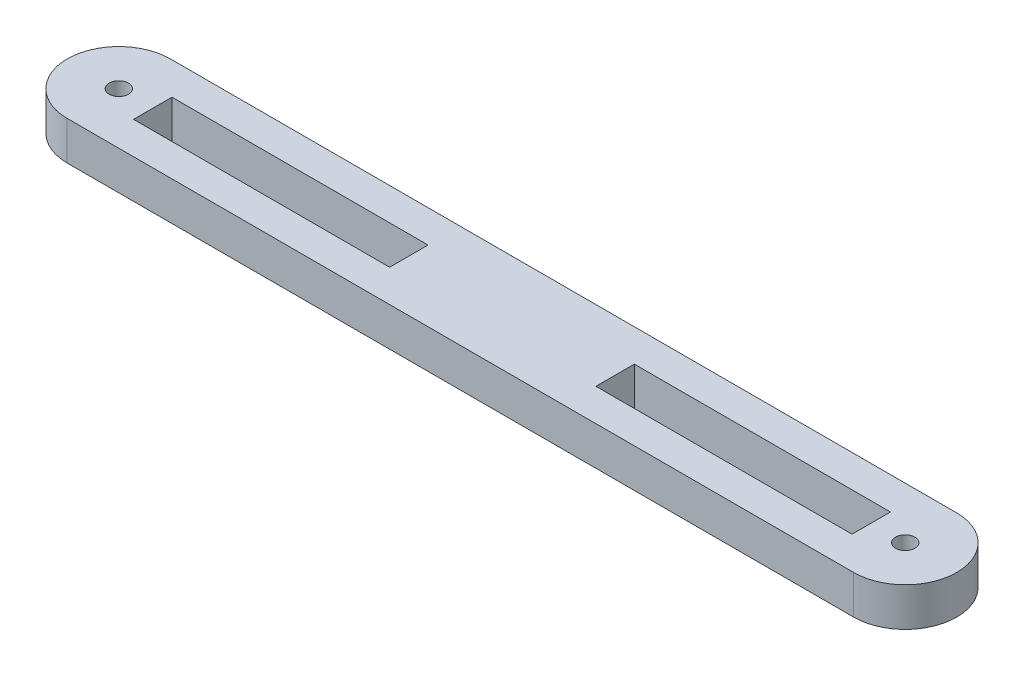
ISO-10303-21;
HEADER;
FILE_DESCRIPTION(('STEP AP214'),'2;1');
FILE_NAME('part.step','',(''),(''),'','','');
FILE_SCHEMA(('AUTOMOTIVE_DESIGN { 1 0 10303 214 1 1 1 1 }'));
ENDSEC;
DATA;
#1=APPLICATION_CONTEXT('core data for automotive mechanical design processes');
#2=APPLICATION_PROTOCOL_DEFINITION('international standard','automotive_design',2000,#1);
#3=PRODUCT_CONTEXT('',#1,'mechanical');
#4=PRODUCT('Part','Part','',(#3));
#5=PRODUCT_RELATED_PRODUCT_CATEGORY('part','',(#4));
#6=PRODUCT_DEFINITION_FORMATION('','',#4);
#7=PRODUCT_DEFINITION_CONTEXT('part definition',#1,'design');
#8=PRODUCT_DEFINITION('design','',#6,#7);
#9=PRODUCT_DEFINITION_SHAPE('','',#8);
#10=(LENGTH_UNIT() NAMED_UNIT(*) SI_UNIT(.MILLI.,.METRE.));
#11=(NAMED_UNIT(*) PLANE_ANGLE_UNIT() SI_UNIT($,.RADIAN.));
#12=(NAMED_UNIT(*) SI_UNIT($,.STERADIAN.) SOLID_ANGLE_UNIT());
#13=UNCERTAINTY_MEASURE_WITH_UNIT(LENGTH_MEASURE(1.E-05),#10,'distance_accuracy_value','');
#14=(GEOMETRIC_REPRESENTATION_CONTEXT(3) GLOBAL_UNCERTAINTY_ASSIGNED_CONTEXT((#13)) GLOBAL_UNIT_ASSIGNED_CONTEXT((#10,
#11,#12)) REPRESENTATION_CONTEXT('',''));
#15=CARTESIAN_POINT('',(0.,0.,0.));
#16=DIRECTION('',(0.,0.,1.));
#17=DIRECTION('',(1.,0.,0.));
#18=AXIS2_PLACEMENT_3D('',#15,#16,#17);
#19=CARTESIAN_POINT('',(0.,6.,0.));
#20=DIRECTION('',(0.,1.,0.));
#21=DIRECTION('',(0.,0.,1.));
#22=AXIS2_PLACEMENT_3D('',#19,#20,#21);
#23=PLANE('',#22);
#24=DIRECTION('',(1.,0.,0.));
#25=VECTOR('',#24,1.);
#26=CARTESIAN_POINT('',(0.,6.,2.98042204926586));
#27=LINE('',#26,#25);
#28=CARTESIAN_POINT('',(5.26854851105268,6.,2.98042204926586));
#29=VERTEX_POINT('',#28);
#30=CARTESIAN_POINT('',(44.999839524994,6.,2.98042204926586));
#31=VERTEX_POINT('',#30);
#32=EDGE_CURVE('E88',#29,#31,#27,.T.);
#33=ORIENTED_EDGE('',*,*,#32,.F.);
#34=DIRECTION('',(0.,0.,1.));
#35=VECTOR('',#34,1.);
#36=CARTESIAN_POINT('',(5.26854851105268,6.,0.));
#37=LINE('',#36,#35);
#38=CARTESIAN_POINT('',(5.26854851105268,6.,-2.98042204926586));
#39=VERTEX_POINT('',#38);
#40=EDGE_CURVE('E187',#39,#29,#37,.T.);
#41=ORIENTED_EDGE('',*,*,#40,.F.);
#42=DIRECTION('',(1.,0.,0.));
#43=VECTOR('',#42,1.);
#44=CARTESIAN_POINT('',(0.,6.,-2.98042204926586));
#45=LINE('',#44,#43);
#46=CARTESIAN_POINT('',(44.999839524994,6.,-2.98042204926586));
#47=VERTEX_POINT('',#46);
#48=EDGE_CURVE('E169',#39,#47,#45,.T.);
#49=ORIENTED_EDGE('',*,*,#48,.T.);
#50=DIRECTION('',(0.,0.,-1.));
#51=VECTOR('',#50,1.);
#52=CARTESIAN_POINT('',(44.999839524994,6.,0.));
#53=LINE('',#52,#51);
#54=EDGE_CURVE('E180',#31,#47,#53,.T.);
#55=ORIENTED_EDGE('',*,*,#54,.F.);
#56=EDGE_LOOP('',(#33,#41,#49,#55));
#57=FACE_BOUND('',#56,.T.);
#58=CARTESIAN_POINT('',(122.,6.,0.));
#59=DIRECTION('',(0.,1.,0.));
#60=DIRECTION('',(0.,0.,1.));
#61=AXIS2_PLACEMENT_3D('',#58,#59,#60);
#62=CIRCLE('',#61,1.5);
#63=CARTESIAN_POINT('',(122.,6.,1.5));
#64=VERTEX_POINT('',#63);
#65=EDGE_CURVE('E236',#64,#64,#62,.T.);
#66=ORIENTED_EDGE('',*,*,#65,.F.);
#67=EDGE_LOOP('',(#66));
#68=FACE_BOUND('',#67,.T.);
#69=CARTESIAN_POINT('',(0.,6.,0.));
#70=DIRECTION('',(0.,1.,0.));
#71=DIRECTION('',(0.,0.,1.));
#72=AXIS2_PLACEMENT_3D('',#69,#70,#71);
#73=CIRCLE('',#72,8.);
#74=CARTESIAN_POINT('',(0.,6.,-8.));
#75=VERTEX_POINT('',#74);
#76=CARTESIAN_POINT('',(0.,6.,8.));
#77=VERTEX_POINT('',#76);
#78=EDGE_CURVE('E244',#75,#77,#73,.T.);
#79=ORIENTED_EDGE('',*,*,#78,.T.);
#80=DIRECTION('',(1.,0.,0.));
#81=VECTOR('',#80,1.);
#82=CARTESIAN_POINT('',(0.,6.,8.));
#83=LINE('',#82,#81);
#84=CARTESIAN_POINT('',(122.,6.,8.));
#85=VERTEX_POINT('',#84);
#86=EDGE_CURVE('E248',#77,#85,#83,.T.);
#87=ORIENTED_EDGE('',*,*,#86,.T.);
#88=CARTESIAN_POINT('',(122.,6.,0.));
#89=DIRECTION('',(0.,1.,0.));
#90=DIRECTION('',(0.,0.,1.));
#91=AXIS2_PLACEMENT_3D('',#88,#89,#90);
#92=CIRCLE('',#91,8.);
#93=CARTESIAN_POINT('',(122.,6.,-8.));
#94=VERTEX_POINT('',#93);
#95=EDGE_CURVE('E252',#85,#94,#92,.T.);
#96=ORIENTED_EDGE('',*,*,#95,.T.);
#97=DIRECTION('',(1.,0.,0.));
#98=VECTOR('',#97,1.);
#99=CARTESIAN_POINT('',(0.,6.,-8.));
#100=LINE('',#99,#98);
#101=EDGE_CURVE('E255',#75,#94,#100,.T.);
#102=ORIENTED_EDGE('',*,*,#101,.F.);
#103=EDGE_LOOP('',(#79,#87,#96,#102));
#104=FACE_BOUND('',#103,.T.);
#105=CARTESIAN_POINT('',(0.,6.,0.));
#106=DIRECTION('',(0.,1.,0.));
#107=DIRECTION('',(0.,0.,1.));
#108=AXIS2_PLACEMENT_3D('',#105,#106,#107);
#109=CIRCLE('',#108,1.5);
#110=CARTESIAN_POINT('',(0.,6.,1.5));
#111=VERTEX_POINT('',#110);
#112=EDGE_CURVE('E228',#111,#111,#109,.T.);
#113=ORIENTED_EDGE('',*,*,#112,.F.);
#114=EDGE_LOOP('',(#113));
#115=FACE_BOUND('',#114,.T.);
#116=DIRECTION('',(-1.,0.,0.));
#117=VECTOR('',#116,1.);
#118=CARTESIAN_POINT('',(105.999839524994,6.,-2.98042204926586));
#119=LINE('',#118,#117);
#120=CARTESIAN_POINT('',(116.731451488947,6.,-2.98042204926586));
#121=VERTEX_POINT('',#120);
#122=CARTESIAN_POINT('',(77.000160475006,6.,-2.98042204926586));
#123=VERTEX_POINT('',#122);
#124=EDGE_CURVE('E214',#121,#123,#119,.T.);
#125=ORIENTED_EDGE('',*,*,#124,.F.);
#126=DIRECTION('',(0.,0.,1.));
#127=VECTOR('',#126,1.);
#128=CARTESIAN_POINT('',(116.731451488947,6.,-2.98042204926586));
#129=LINE('',#128,#127);
#130=CARTESIAN_POINT('',(116.731451488947,6.,2.98042204926586));
#131=VERTEX_POINT('',#130);
#132=EDGE_CURVE('E96',#121,#131,#129,.T.);
#133=ORIENTED_EDGE('',*,*,#132,.T.);
#134=DIRECTION('',(-1.,0.,0.));
#135=VECTOR('',#134,1.);
#136=CARTESIAN_POINT('',(105.999839524994,6.,2.98042204926586));
#137=LINE('',#136,#135);
#138=CARTESIAN_POINT('',(77.000160475006,6.,2.98042204926586));
#139=VERTEX_POINT('',#138);
#140=EDGE_CURVE('E222',#131,#139,#137,.T.);
#141=ORIENTED_EDGE('',*,*,#140,.T.);
#142=DIRECTION('',(0.,0.,-1.));
#143=VECTOR('',#142,1.);
#144=CARTESIAN_POINT('',(77.000160475006,6.,2.98042204926586));
#145=LINE('',#144,#143);
#146=EDGE_CURVE('E218',#139,#123,#145,.T.);
#147=ORIENTED_EDGE('',*,*,#146,.T.);
#148=EDGE_LOOP('',(#125,#133,#141,#147));
#149=FACE_BOUND('',#148,.T.);
#150=ADVANCED_FACE('F72',(#57,#68,#104,#115,#149),#23,.T.);
#151=CARTESIAN_POINT('',(0.,0.,0.));
#152=DIRECTION('',(0.,1.,0.));
#153=DIRECTION('',(0.,0.,1.));
#154=AXIS2_PLACEMENT_3D('',#151,#152,#153);
#155=PLANE('',#154);
#156=DIRECTION('',(0.,0.,1.));
#157=VECTOR('',#156,1.);
#158=CARTESIAN_POINT('',(5.26854851105268,0.,0.));
#159=LINE('',#158,#157);
#160=CARTESIAN_POINT('',(5.26854851105268,0.,-2.98042204926586));
#161=VERTEX_POINT('',#160);
#162=CARTESIAN_POINT('',(5.26854851105268,0.,2.98042204926586));
#163=VERTEX_POINT('',#162);
#164=EDGE_CURVE('E81',#161,#163,#159,.T.);
#165=ORIENTED_EDGE('',*,*,#164,.T.);
#166=DIRECTION('',(1.,0.,0.));
#167=VECTOR('',#166,1.);
#168=CARTESIAN_POINT('',(0.,0.,2.98042204926586));
#169=LINE('',#168,#167);
#170=CARTESIAN_POINT('',(44.999839524994,0.,2.98042204926586));
#171=VERTEX_POINT('',#170);
#172=EDGE_CURVE('E12',#163,#171,#169,.T.);
#173=ORIENTED_EDGE('',*,*,#172,.T.);
#174=DIRECTION('',(0.,0.,-1.));
#175=VECTOR('',#174,1.);
#176=CARTESIAN_POINT('',(44.999839524994,0.,0.));
#177=LINE('',#176,#175);
#178=CARTESIAN_POINT('',(44.999839524994,0.,-2.98042204926586));
#179=VERTEX_POINT('',#178);
#180=EDGE_CURVE('E300',#171,#179,#177,.T.);
#181=ORIENTED_EDGE('',*,*,#180,.T.);
#182=DIRECTION('',(1.,0.,0.));
#183=VECTOR('',#182,1.);
#184=CARTESIAN_POINT('',(0.,0.,-2.98042204926586));
#185=LINE('',#184,#183);
#186=EDGE_CURVE('E172',#161,#179,#185,.T.);
#187=ORIENTED_EDGE('',*,*,#186,.F.);
#188=EDGE_LOOP('',(#165,#173,#181,#187));
#189=FACE_BOUND('',#188,.T.);
#190=CARTESIAN_POINT('',(0.,0.,0.));
#191=DIRECTION('',(0.,1.,0.));
#192=DIRECTION('',(0.,0.,1.));
#193=AXIS2_PLACEMENT_3D('',#190,#191,#192);
#194=CIRCLE('',#193,1.5);
#195=CARTESIAN_POINT('',(0.,0.,1.5));
#196=VERTEX_POINT('',#195);
#197=EDGE_CURVE('E197',#196,#196,#194,.T.);
#198=ORIENTED_EDGE('',*,*,#197,.T.);
#199=EDGE_LOOP('',(#198));
#200=FACE_BOUND('',#199,.T.);
#201=CARTESIAN_POINT('',(122.,0.,0.));
#202=DIRECTION('',(0.,1.,0.));
#203=DIRECTION('',(0.,0.,1.));
#204=AXIS2_PLACEMENT_3D('',#201,#202,#203);
#205=CIRCLE('',#204,1.5);
#206=CARTESIAN_POINT('',(122.,0.,1.5));
#207=VERTEX_POINT('',#206);
#208=EDGE_CURVE('E232',#207,#207,#205,.T.);
#209=ORIENTED_EDGE('',*,*,#208,.T.);
#210=EDGE_LOOP('',(#209));
#211=FACE_BOUND('',#210,.T.);
#212=CARTESIAN_POINT('',(0.,0.,0.));
#213=DIRECTION('',(0.,1.,0.));
#214=DIRECTION('',(0.,0.,1.));
#215=AXIS2_PLACEMENT_3D('',#212,#213,#214);
#216=CIRCLE('',#215,8.);
#217=CARTESIAN_POINT('',(0.,0.,-8.));
#218=VERTEX_POINT('',#217);
#219=CARTESIAN_POINT('',(0.,0.,8.));
#220=VERTEX_POINT('',#219);
#221=EDGE_CURVE('E240',#218,#220,#216,.T.);
#222=ORIENTED_EDGE('',*,*,#221,.F.);
#223=DIRECTION('',(1.,0.,0.));
#224=VECTOR('',#223,1.);
#225=CARTESIAN_POINT('',(0.,0.,-8.));
#226=LINE('',#225,#224);
#227=CARTESIAN_POINT('',(122.,0.,-8.));
#228=VERTEX_POINT('',#227);
#229=EDGE_CURVE('E249',#218,#228,#226,.T.);
#230=ORIENTED_EDGE('',*,*,#229,.T.);
#231=CARTESIAN_POINT('',(122.,0.,0.));
#232=DIRECTION('',(0.,1.,0.));
#233=DIRECTION('',(0.,0.,1.));
#234=AXIS2_PLACEMENT_3D('',#231,#232,#233);
#235=CIRCLE('',#234,8.);
#236=CARTESIAN_POINT('',(122.,0.,8.));
#237=VERTEX_POINT('',#236);
#238=EDGE_CURVE('E266',#237,#228,#235,.T.);
#239=ORIENTED_EDGE('',*,*,#238,.F.);
#240=DIRECTION('',(1.,0.,0.));
#241=VECTOR('',#240,1.);
#242=CARTESIAN_POINT('',(0.,0.,8.));
#243=LINE('',#242,#241);
#244=EDGE_CURVE('E263',#220,#237,#243,.T.);
#245=ORIENTED_EDGE('',*,*,#244,.F.);
#246=EDGE_LOOP('',(#222,#230,#239,#245));
#247=FACE_BOUND('',#246,.T.);
#248=DIRECTION('',(0.,0.,1.));
#249=VECTOR('',#248,1.);
#250=CARTESIAN_POINT('',(116.731451488947,0.,0.));
#251=LINE('',#250,#249);
#252=CARTESIAN_POINT('',(116.731451488947,0.,-2.98042204926586));
#253=VERTEX_POINT('',#252);
#254=CARTESIAN_POINT('',(116.731451488947,0.,2.98042204926586));
#255=VERTEX_POINT('',#254);
#256=EDGE_CURVE('E297',#253,#255,#251,.T.);
#257=ORIENTED_EDGE('',*,*,#256,.F.);
#258=DIRECTION('',(-1.,0.,0.));
#259=VECTOR('',#258,1.);
#260=CARTESIAN_POINT('',(0.,0.,-2.98042204926586));
#261=LINE('',#260,#259);
#262=CARTESIAN_POINT('',(77.000160475006,0.,-2.98042204926586));
#263=VERTEX_POINT('',#262);
#264=EDGE_CURVE('E286',#253,#263,#261,.T.);
#265=ORIENTED_EDGE('',*,*,#264,.T.);
#266=DIRECTION('',(0.,0.,-1.));
#267=VECTOR('',#266,1.);
#268=CARTESIAN_POINT('',(77.000160475006,0.,0.));
#269=LINE('',#268,#267);
#270=CARTESIAN_POINT('',(77.000160475006,0.,2.98042204926586));
#271=VERTEX_POINT('',#270);
#272=EDGE_CURVE('E290',#271,#263,#269,.T.);
#273=ORIENTED_EDGE('',*,*,#272,.F.);
#274=DIRECTION('',(-1.,0.,0.));
#275=VECTOR('',#274,1.);
#276=CARTESIAN_POINT('',(0.,0.,2.98042204926586));
#277=LINE('',#276,#275);
#278=EDGE_CURVE('E294',#255,#271,#277,.T.);
#279=ORIENTED_EDGE('',*,*,#278,.F.);
#280=EDGE_LOOP('',(#257,#265,#273,#279));
#281=FACE_BOUND('',#280,.T.);
#282=ADVANCED_FACE('F307',(#189,#200,#211,#247,#281),#155,.F.);
#283=CARTESIAN_POINT('',(0.,6.,0.));
#284=DIRECTION('',(0.,-1.,0.));
#285=DIRECTION('',(0.,0.,-1.));
#286=AXIS2_PLACEMENT_3D('',#283,#284,#285);
#287=CYLINDRICAL_SURFACE('',#286,8.);
#288=ORIENTED_EDGE('',*,*,#221,.T.);
#289=DIRECTION('',(0.,-1.,0.));
#290=VECTOR('',#289,1.);
#291=CARTESIAN_POINT('',(0.,6.,8.));
#292=LINE('',#291,#290);
#293=EDGE_CURVE('E282',#77,#220,#292,.T.);
#294=ORIENTED_EDGE('',*,*,#293,.F.);
#295=ORIENTED_EDGE('',*,*,#78,.F.);
#296=DIRECTION('',(0.,-1.,0.));
#297=VECTOR('',#296,1.);
#298=CARTESIAN_POINT('',(0.,6.,-8.));
#299=LINE('',#298,#297);
#300=EDGE_CURVE('E259',#75,#218,#299,.T.);
#301=ORIENTED_EDGE('',*,*,#300,.T.);
#302=EDGE_LOOP('',(#288,#294,#295,#301));
#303=FACE_BOUND('',#302,.T.);
#304=ADVANCED_FACE('F74',(#303),#287,.T.);
#305=CARTESIAN_POINT('',(0.,6.,8.));
#306=DIRECTION('',(0.,0.,-1.));
#307=DIRECTION('',(-1.,0.,0.));
#308=AXIS2_PLACEMENT_3D('',#305,#306,#307);
#309=PLANE('',#308);
#310=ORIENTED_EDGE('',*,*,#244,.T.);
#311=DIRECTION('',(0.,-1.,0.));
#312=VECTOR('',#311,1.);
#313=CARTESIAN_POINT('',(122.,6.,8.));
#314=LINE('',#313,#312);
#315=EDGE_CURVE('E278',#85,#237,#314,.T.);
#316=ORIENTED_EDGE('',*,*,#315,.F.);
#317=ORIENTED_EDGE('',*,*,#86,.F.);
#318=ORIENTED_EDGE('',*,*,#293,.T.);
#319=EDGE_LOOP('',(#310,#316,#317,#318));
#320=FACE_BOUND('',#319,.T.);
#321=ADVANCED_FACE('F343',(#320),#309,.F.);
#322=CARTESIAN_POINT('',(122.,6.,0.));
#323=DIRECTION('',(0.,-1.,0.));
#324=DIRECTION('',(0.,0.,-1.));
#325=AXIS2_PLACEMENT_3D('',#322,#323,#324);
#326=CYLINDRICAL_SURFACE('',#325,8.);
#327=ORIENTED_EDGE('',*,*,#238,.T.);
#328=DIRECTION('',(0.,-1.,0.));
#329=VECTOR('',#328,1.);
#330=CARTESIAN_POINT('',(122.,6.,-8.));
#331=LINE('',#330,#329);
#332=EDGE_CURVE('E275',#94,#228,#331,.T.);
#333=ORIENTED_EDGE('',*,*,#332,.F.);
#334=ORIENTED_EDGE('',*,*,#95,.F.);
#335=ORIENTED_EDGE('',*,*,#315,.T.);
#336=EDGE_LOOP('',(#327,#333,#334,#335));
#337=FACE_BOUND('',#336,.T.);
#338=ADVANCED_FACE('F340',(#337),#326,.T.);
#339=CARTESIAN_POINT('',(0.,6.,-8.));
#340=DIRECTION('',(0.,0.,-1.));
#341=DIRECTION('',(-1.,0.,0.));
#342=AXIS2_PLACEMENT_3D('',#339,#340,#341);
#343=PLANE('',#342);
#344=ORIENTED_EDGE('',*,*,#229,.F.);
#345=ORIENTED_EDGE('',*,*,#300,.F.);
#346=ORIENTED_EDGE('',*,*,#101,.T.);
#347=ORIENTED_EDGE('',*,*,#332,.T.);
#348=EDGE_LOOP('',(#344,#345,#346,#347));
#349=FACE_BOUND('',#348,.T.);
#350=ADVANCED_FACE('F337',(#349),#343,.T.);
#351=CARTESIAN_POINT('',(122.,6.,0.));
#352=DIRECTION('',(0.,-1.,0.));
#353=DIRECTION('',(0.,0.,-1.));
#354=AXIS2_PLACEMENT_3D('',#351,#352,#353);
#355=CYLINDRICAL_SURFACE('',#354,1.5);
#356=ORIENTED_EDGE('',*,*,#65,.T.);
#357=EDGE_LOOP('',(#356));
#358=FACE_BOUND('',#357,.T.);
#359=ORIENTED_EDGE('',*,*,#208,.F.);
#360=EDGE_LOOP('',(#359));
#361=FACE_BOUND('',#360,.T.);
#362=ADVANCED_FACE('F334',(#358,#361),#355,.F.);
#363=CARTESIAN_POINT('',(0.,6.,0.));
#364=DIRECTION('',(0.,-1.,0.));
#365=DIRECTION('',(0.,0.,-1.));
#366=AXIS2_PLACEMENT_3D('',#363,#364,#365);
#367=CYLINDRICAL_SURFACE('',#366,1.5);
#368=ORIENTED_EDGE('',*,*,#112,.T.);
#369=EDGE_LOOP('',(#368));
#370=FACE_BOUND('',#369,.T.);
#371=ORIENTED_EDGE('',*,*,#197,.F.);
#372=EDGE_LOOP('',(#371));
#373=FACE_BOUND('',#372,.T.);
#374=ADVANCED_FACE('F384',(#370,#373),#367,.F.);
#375=CARTESIAN_POINT('',(116.731451488947,-8.,-2.98042204926586));
#376=DIRECTION('',(-1.,0.,0.));
#377=DIRECTION('',(0.,0.,1.));
#378=AXIS2_PLACEMENT_3D('',#375,#376,#377);
#379=PLANE('',#378);
#380=ORIENTED_EDGE('',*,*,#256,.T.);
#381=DIRECTION('',(0.,1.,0.));
#382=VECTOR('',#381,1.);
#383=CARTESIAN_POINT('',(116.731451488947,-8.,2.98042204926586));
#384=LINE('',#383,#382);
#385=EDGE_CURVE('E205',#255,#131,#384,.T.);
#386=ORIENTED_EDGE('',*,*,#385,.T.);
#387=ORIENTED_EDGE('',*,*,#132,.F.);
#388=DIRECTION('',(0.,1.,0.));
#389=VECTOR('',#388,1.);
#390=CARTESIAN_POINT('',(116.731451488947,-8.,-2.98042204926586));
#391=LINE('',#390,#389);
#392=EDGE_CURVE('E202',#253,#121,#391,.T.);
#393=ORIENTED_EDGE('',*,*,#392,.F.);
#394=EDGE_LOOP('',(#380,#386,#387,#393));
#395=FACE_BOUND('',#394,.T.);
#396=ADVANCED_FACE('F369',(#395),#379,.T.);
#397=CARTESIAN_POINT('',(105.999839524994,-8.,2.98042204926586));
#398=DIRECTION('',(0.,0.,-1.));
#399=DIRECTION('',(-1.,0.,0.));
#400=AXIS2_PLACEMENT_3D('',#397,#398,#399);
#401=PLANE('',#400);
#402=ORIENTED_EDGE('',*,*,#278,.T.);
#403=DIRECTION('',(0.,1.,0.));
#404=VECTOR('',#403,1.);
#405=CARTESIAN_POINT('',(77.000160475006,-8.,2.98042204926586));
#406=LINE('',#405,#404);
#407=EDGE_CURVE('E208',#271,#139,#406,.T.);
#408=ORIENTED_EDGE('',*,*,#407,.T.);
#409=ORIENTED_EDGE('',*,*,#140,.F.);
#410=ORIENTED_EDGE('',*,*,#385,.F.);
#411=EDGE_LOOP('',(#402,#408,#409,#410));
#412=FACE_BOUND('',#411,.T.);
#413=ADVANCED_FACE('F375',(#412),#401,.T.);
#414=CARTESIAN_POINT('',(77.000160475006,-8.,2.98042204926586));
#415=DIRECTION('',(1.,0.,0.));
#416=DIRECTION('',(0.,0.,-1.));
#417=AXIS2_PLACEMENT_3D('',#414,#415,#416);
#418=PLANE('',#417);
#419=ORIENTED_EDGE('',*,*,#272,.T.);
#420=DIRECTION('',(0.,1.,0.));
#421=VECTOR('',#420,1.);
#422=CARTESIAN_POINT('',(77.000160475006,-8.,-2.98042204926586));
#423=LINE('',#422,#421);
#424=EDGE_CURVE('E211',#263,#123,#423,.T.);
#425=ORIENTED_EDGE('',*,*,#424,.T.);
#426=ORIENTED_EDGE('',*,*,#146,.F.);
#427=ORIENTED_EDGE('',*,*,#407,.F.);
#428=EDGE_LOOP('',(#419,#425,#426,#427));
#429=FACE_BOUND('',#428,.T.);
#430=ADVANCED_FACE('F321',(#429),#418,.T.);
#431=CARTESIAN_POINT('',(105.999839524994,-8.,-2.98042204926586));
#432=DIRECTION('',(0.,0.,-1.));
#433=DIRECTION('',(-1.,0.,0.));
#434=AXIS2_PLACEMENT_3D('',#431,#432,#433);
#435=PLANE('',#434);
#436=ORIENTED_EDGE('',*,*,#392,.T.);
#437=ORIENTED_EDGE('',*,*,#124,.T.);
#438=ORIENTED_EDGE('',*,*,#424,.F.);
#439=ORIENTED_EDGE('',*,*,#264,.F.);
#440=EDGE_LOOP('',(#436,#437,#438,#439));
#441=FACE_BOUND('',#440,.T.);
#442=ADVANCED_FACE('F314',(#441),#435,.F.);
#443=CARTESIAN_POINT('',(0.,-8.,2.98042204926586));
#444=DIRECTION('',(0.,0.,1.));
#445=DIRECTION('',(1.,0.,0.));
#446=AXIS2_PLACEMENT_3D('',#443,#444,#445);
#447=PLANE('',#446);
#448=DIRECTION('',(0.,1.,0.));
#449=VECTOR('',#448,1.);
#450=CARTESIAN_POINT('',(5.26854851105268,-8.,2.98042204926586));
#451=LINE('',#450,#449);
#452=EDGE_CURVE('E194',#163,#29,#451,.T.);
#453=ORIENTED_EDGE('',*,*,#452,.T.);
#454=ORIENTED_EDGE('',*,*,#32,.T.);
#455=DIRECTION('',(0.,1.,0.));
#456=VECTOR('',#455,1.);
#457=CARTESIAN_POINT('',(44.999839524994,-8.,2.98042204926586));
#458=LINE('',#457,#456);
#459=EDGE_CURVE('E177',#171,#31,#458,.T.);
#460=ORIENTED_EDGE('',*,*,#459,.F.);
#461=ORIENTED_EDGE('',*,*,#172,.F.);
#462=EDGE_LOOP('',(#453,#454,#460,#461));
#463=FACE_BOUND('',#462,.T.);
#464=ADVANCED_FACE('F312',(#463),#447,.F.);
#465=CARTESIAN_POINT('',(5.26854851105268,-8.,0.));
#466=DIRECTION('',(-1.,0.,0.));
#467=DIRECTION('',(0.,0.,1.));
#468=AXIS2_PLACEMENT_3D('',#465,#466,#467);
#469=PLANE('',#468);
#470=DIRECTION('',(0.,1.,0.));
#471=VECTOR('',#470,1.);
#472=CARTESIAN_POINT('',(5.26854851105268,-8.,-2.98042204926586));
#473=LINE('',#472,#471);
#474=EDGE_CURVE('E176',#161,#39,#473,.T.);
#475=ORIENTED_EDGE('',*,*,#474,.T.);
#476=ORIENTED_EDGE('',*,*,#40,.T.);
#477=ORIENTED_EDGE('',*,*,#452,.F.);
#478=ORIENTED_EDGE('',*,*,#164,.F.);
#479=EDGE_LOOP('',(#475,#476,#477,#478));
#480=FACE_BOUND('',#479,.T.);
#481=ADVANCED_FACE('F311',(#480),#469,.F.);
#482=CARTESIAN_POINT('',(0.,-8.,-2.98042204926586));
#483=DIRECTION('',(0.,0.,1.));
#484=DIRECTION('',(1.,0.,0.));
#485=AXIS2_PLACEMENT_3D('',#482,#483,#484);
#486=PLANE('',#485);
#487=ORIENTED_EDGE('',*,*,#186,.T.);
#488=DIRECTION('',(0.,1.,0.));
#489=VECTOR('',#488,1.);
#490=CARTESIAN_POINT('',(44.999839524994,-8.,-2.98042204926586));
#491=LINE('',#490,#489);
#492=EDGE_CURVE('E164',#179,#47,#491,.T.);
#493=ORIENTED_EDGE('',*,*,#492,.T.);
#494=ORIENTED_EDGE('',*,*,#48,.F.);
#495=ORIENTED_EDGE('',*,*,#474,.F.);
#496=EDGE_LOOP('',(#487,#493,#494,#495));
#497=FACE_BOUND('',#496,.T.);
#498=ADVANCED_FACE('F166',(#497),#486,.T.);
#499=CARTESIAN_POINT('',(44.999839524994,-8.,0.));
#500=DIRECTION('',(1.,0.,0.));
#501=DIRECTION('',(0.,0.,-1.));
#502=AXIS2_PLACEMENT_3D('',#499,#500,#501);
#503=PLANE('',#502);
#504=ORIENTED_EDGE('',*,*,#459,.T.);
#505=ORIENTED_EDGE('',*,*,#54,.T.);
#506=ORIENTED_EDGE('',*,*,#492,.F.);
#507=ORIENTED_EDGE('',*,*,#180,.F.);
#508=EDGE_LOOP('',(#504,#505,#506,#507));
#509=FACE_BOUND('',#508,.T.);
#510=ADVANCED_FACE('F181',(#509),#503,.F.);
#511=CLOSED_SHELL('',(#150,#282,#304,#321,#338,#350,#362,#374,#396,#413,#430,#442,#464,#481,
#498,#510));
#512=MANIFOLD_SOLID_BREP('B2',#511);
#513=ADVANCED_BREP_SHAPE_REPRESENTATION('',(#18,#512),#14);
#514=SHAPE_DEFINITION_REPRESENTATION(#9,#513);
ENDSEC;
END-ISO-10303-21;
